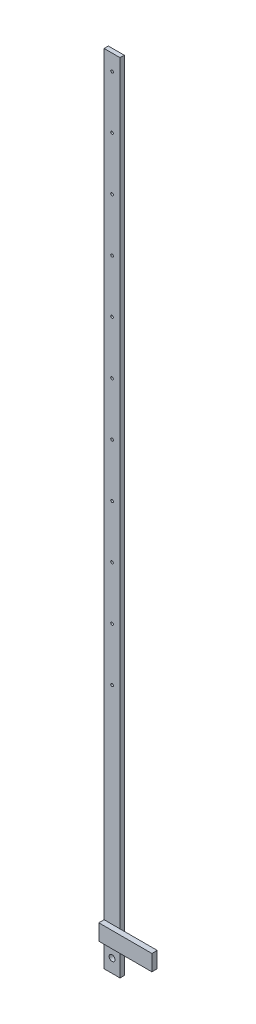
ISO-10303-21;
HEADER;
FILE_DESCRIPTION(('STEP AP214'),'2;1');
FILE_NAME('part.step','',(''),(''),'','','');
FILE_SCHEMA(('AUTOMOTIVE_DESIGN { 1 0 10303 214 1 1 1 1 }'));
ENDSEC;
DATA;
#1=APPLICATION_CONTEXT('core data for automotive mechanical design processes');
#2=APPLICATION_PROTOCOL_DEFINITION('international standard','automotive_design',2000,#1);
#3=PRODUCT_CONTEXT('',#1,'mechanical');
#4=PRODUCT('Part','Part','',(#3));
#5=PRODUCT_RELATED_PRODUCT_CATEGORY('part','',(#4));
#6=PRODUCT_DEFINITION_FORMATION('','',#4);
#7=PRODUCT_DEFINITION_CONTEXT('part definition',#1,'design');
#8=PRODUCT_DEFINITION('design','',#6,#7);
#9=PRODUCT_DEFINITION_SHAPE('','',#8);
#10=(LENGTH_UNIT() NAMED_UNIT(*) SI_UNIT(.MILLI.,.METRE.));
#11=(NAMED_UNIT(*) PLANE_ANGLE_UNIT() SI_UNIT($,.RADIAN.));
#12=(NAMED_UNIT(*) SI_UNIT($,.STERADIAN.) SOLID_ANGLE_UNIT());
#13=UNCERTAINTY_MEASURE_WITH_UNIT(LENGTH_MEASURE(1.E-05),#10,'distance_accuracy_value','');
#14=(GEOMETRIC_REPRESENTATION_CONTEXT(3) GLOBAL_UNCERTAINTY_ASSIGNED_CONTEXT((#13)) GLOBAL_UNIT_ASSIGNED_CONTEXT((#10,
#11,#12)) REPRESENTATION_CONTEXT('',''));
#15=CARTESIAN_POINT('',(0.,0.,0.));
#16=DIRECTION('',(0.,0.,1.));
#17=DIRECTION('',(1.,0.,0.));
#18=AXIS2_PLACEMENT_3D('',#15,#16,#17);
#19=CARTESIAN_POINT('',(0.,0.,0.8));
#20=DIRECTION('',(0.,0.,-1.));
#21=DIRECTION('',(-1.,0.,0.));
#22=AXIS2_PLACEMENT_3D('',#19,#20,#21);
#23=PLANE('',#22);
#24=CARTESIAN_POINT('',(-3.08114075777285E-13,44.5,0.8));
#25=DIRECTION('',(0.,0.,1.));
#26=DIRECTION('',(1.,0.,0.));
#27=AXIS2_PLACEMENT_3D('',#24,#25,#26);
#28=CIRCLE('',#27,0.25);
#29=CARTESIAN_POINT('',(0.249999999999692,44.5,0.8));
#30=VERTEX_POINT('',#29);
#31=EDGE_CURVE('E131',#30,#30,#28,.T.);
#32=ORIENTED_EDGE('',*,*,#31,.F.);
#33=EDGE_LOOP('',(#32));
#34=FACE_BOUND('',#33,.T.);
#35=CARTESIAN_POINT('',(1.10311582467672E-13,84.5,0.8));
#36=DIRECTION('',(0.,0.,1.));
#37=DIRECTION('',(1.,0.,0.));
#38=AXIS2_PLACEMENT_3D('',#35,#36,#37);
#39=CIRCLE('',#38,0.24999999999986);
#40=CARTESIAN_POINT('',(0.24999999999997,84.5,0.8));
#41=VERTEX_POINT('',#40);
#42=EDGE_CURVE('E495',#41,#41,#39,.T.);
#43=ORIENTED_EDGE('',*,*,#42,.F.);
#44=EDGE_LOOP('',(#43));
#45=FACE_BOUND('',#44,.T.);
#46=CARTESIAN_POINT('',(-3.08114075777285E-13,54.5,0.8));
#47=DIRECTION('',(0.,0.,1.));
#48=DIRECTION('',(1.,0.,0.));
#49=AXIS2_PLACEMENT_3D('',#46,#47,#48);
#50=CIRCLE('',#49,0.25);
#51=CARTESIAN_POINT('',(0.249999999999692,54.5,0.8));
#52=VERTEX_POINT('',#51);
#53=EDGE_CURVE('E483',#52,#52,#50,.T.);
#54=ORIENTED_EDGE('',*,*,#53,.F.);
#55=EDGE_LOOP('',(#54));
#56=FACE_BOUND('',#55,.T.);
#57=CARTESIAN_POINT('',(0.,104.5,0.8));
#58=DIRECTION('',(0.,0.,1.));
#59=DIRECTION('',(1.,0.,0.));
#60=AXIS2_PLACEMENT_3D('',#57,#58,#59);
#61=CIRCLE('',#60,0.249999999999907);
#62=CARTESIAN_POINT('',(0.249999999999968,104.5,0.8));
#63=VERTEX_POINT('',#62);
#64=EDGE_CURVE('E471',#63,#63,#61,.T.);
#65=ORIENTED_EDGE('',*,*,#64,.F.);
#66=EDGE_LOOP('',(#65));
#67=FACE_BOUND('',#66,.T.);
#68=CARTESIAN_POINT('',(0.,124.5,0.8));
#69=DIRECTION('',(0.,0.,1.));
#70=DIRECTION('',(1.,0.,0.));
#71=AXIS2_PLACEMENT_3D('',#68,#69,#70);
#72=CIRCLE('',#71,0.24999999999995);
#73=CARTESIAN_POINT('',(0.249999999999962,124.5,0.8));
#74=VERTEX_POINT('',#73);
#75=EDGE_CURVE('E459',#74,#74,#72,.T.);
#76=ORIENTED_EDGE('',*,*,#75,.F.);
#77=EDGE_LOOP('',(#76));
#78=FACE_BOUND('',#77,.T.);
#79=CARTESIAN_POINT('',(0.,144.5,0.8));
#80=DIRECTION('',(0.,0.,1.));
#81=DIRECTION('',(1.,0.,0.));
#82=AXIS2_PLACEMENT_3D('',#79,#80,#81);
#83=CIRCLE('',#82,0.250000000000008);
#84=CARTESIAN_POINT('',(0.249999999999973,144.5,0.8));
#85=VERTEX_POINT('',#84);
#86=EDGE_CURVE('E447',#85,#85,#83,.T.);
#87=ORIENTED_EDGE('',*,*,#86,.F.);
#88=EDGE_LOOP('',(#87));
#89=FACE_BOUND('',#88,.T.);
#90=CARTESIAN_POINT('',(0.,134.5,0.8));
#91=DIRECTION('',(0.,0.,1.));
#92=DIRECTION('',(1.,0.,0.));
#93=AXIS2_PLACEMENT_3D('',#90,#91,#92);
#94=CIRCLE('',#93,0.249999999999977);
#95=CARTESIAN_POINT('',(0.249999999999965,134.5,0.8));
#96=VERTEX_POINT('',#95);
#97=EDGE_CURVE('E453',#96,#96,#94,.T.);
#98=ORIENTED_EDGE('',*,*,#97,.F.);
#99=EDGE_LOOP('',(#98));
#100=FACE_BOUND('',#99,.T.);
#101=CARTESIAN_POINT('',(0.,114.5,0.8));
#102=DIRECTION('',(0.,0.,1.));
#103=DIRECTION('',(1.,0.,0.));
#104=AXIS2_PLACEMENT_3D('',#101,#102,#103);
#105=CIRCLE('',#104,0.249999999999926);
#106=CARTESIAN_POINT('',(0.249999999999963,114.5,0.8));
#107=VERTEX_POINT('',#106);
#108=EDGE_CURVE('E465',#107,#107,#105,.T.);
#109=ORIENTED_EDGE('',*,*,#108,.F.);
#110=EDGE_LOOP('',(#109));
#111=FACE_BOUND('',#110,.T.);
#112=CARTESIAN_POINT('',(-3.08114075777286E-13,64.5,0.8));
#113=DIRECTION('',(0.,0.,1.));
#114=DIRECTION('',(1.,0.,0.));
#115=AXIS2_PLACEMENT_3D('',#112,#113,#114);
#116=CIRCLE('',#115,0.25);
#117=CARTESIAN_POINT('',(0.249999999999692,64.5,0.8));
#118=VERTEX_POINT('',#117);
#119=EDGE_CURVE('E477',#118,#118,#116,.T.);
#120=ORIENTED_EDGE('',*,*,#119,.F.);
#121=EDGE_LOOP('',(#120));
#122=FACE_BOUND('',#121,.T.);
#123=CARTESIAN_POINT('',(0.,94.5,0.8));
#124=DIRECTION('',(0.,0.,1.));
#125=DIRECTION('',(1.,0.,0.));
#126=AXIS2_PLACEMENT_3D('',#123,#124,#125);
#127=CIRCLE('',#126,0.249999999999884);
#128=CARTESIAN_POINT('',(0.249999999999969,94.5,0.8));
#129=VERTEX_POINT('',#128);
#130=EDGE_CURVE('E489',#129,#129,#127,.T.);
#131=ORIENTED_EDGE('',*,*,#130,.F.);
#132=EDGE_LOOP('',(#131));
#133=FACE_BOUND('',#132,.T.);
#134=CARTESIAN_POINT('',(1.34804518450619E-13,74.5,0.8));
#135=DIRECTION('',(0.,0.,1.));
#136=DIRECTION('',(1.,0.,0.));
#137=AXIS2_PLACEMENT_3D('',#134,#135,#136);
#138=CIRCLE('',#137,0.249999999999833);
#139=CARTESIAN_POINT('',(0.249999999999968,74.5,0.8));
#140=VERTEX_POINT('',#139);
#141=EDGE_CURVE('E501',#140,#140,#138,.T.);
#142=ORIENTED_EDGE('',*,*,#141,.F.);
#143=EDGE_LOOP('',(#142));
#144=FACE_BOUND('',#143,.T.);
#145=DIRECTION('',(-1.,0.,0.));
#146=VECTOR('',#145,1.);
#147=CARTESIAN_POINT('',(-1.50000000000004,5.5,0.8));
#148=LINE('',#147,#146);
#149=CARTESIAN_POINT('',(1.5,5.5,0.8));
#150=VERTEX_POINT('',#149);
#151=CARTESIAN_POINT('',(-1.5,5.5,0.8));
#152=VERTEX_POINT('',#151);
#153=EDGE_CURVE('E11',#150,#152,#148,.T.);
#154=ORIENTED_EDGE('',*,*,#153,.F.);
#155=DIRECTION('',(0.,1.,0.));
#156=VECTOR('',#155,1.);
#157=CARTESIAN_POINT('',(1.5,-2.5,0.8));
#158=LINE('',#157,#156);
#159=CARTESIAN_POINT('',(1.5,147.5,0.8));
#160=VERTEX_POINT('',#159);
#161=EDGE_CURVE('E166',#150,#160,#158,.T.);
#162=ORIENTED_EDGE('',*,*,#161,.T.);
#163=DIRECTION('',(-1.,0.,0.));
#164=VECTOR('',#163,1.);
#165=CARTESIAN_POINT('',(-1.50000000000004,147.5,0.8));
#166=LINE('',#165,#164);
#167=CARTESIAN_POINT('',(-1.50000000000004,147.5,0.8));
#168=VERTEX_POINT('',#167);
#169=EDGE_CURVE('E169',#160,#168,#166,.T.);
#170=ORIENTED_EDGE('',*,*,#169,.T.);
#171=DIRECTION('',(0.,-1.,0.));
#172=VECTOR('',#171,1.);
#173=CARTESIAN_POINT('',(-1.5,-2.5,0.8));
#174=LINE('',#173,#172);
#175=EDGE_CURVE('E155',#168,#152,#174,.T.);
#176=ORIENTED_EDGE('',*,*,#175,.T.);
#177=EDGE_LOOP('',(#154,#162,#170,#176));
#178=FACE_BOUND('',#177,.T.);
#179=ADVANCED_FACE('F33',(#34,#45,#56,#67,#78,#89,#100,#111,#122,#133,#144,#178),#23,.F.);
#180=CARTESIAN_POINT('',(0.,0.,0.8));
#181=DIRECTION('',(0.,0.,1.));
#182=DIRECTION('',(1.,0.,0.));
#183=AXIS2_PLACEMENT_3D('',#180,#181,#182);
#184=CIRCLE('',#183,0.55);
#185=CARTESIAN_POINT('',(0.55,0.,0.8));
#186=VERTEX_POINT('',#185);
#187=EDGE_CURVE('E176',#186,#186,#184,.T.);
#188=ORIENTED_EDGE('',*,*,#187,.F.);
#189=EDGE_LOOP('',(#188));
#190=FACE_BOUND('',#189,.T.);
#191=DIRECTION('',(1.,0.,0.));
#192=VECTOR('',#191,1.);
#193=CARTESIAN_POINT('',(-1.50000000000004,2.5,0.8));
#194=LINE('',#193,#192);
#195=CARTESIAN_POINT('',(-1.5,2.5,0.8));
#196=VERTEX_POINT('',#195);
#197=CARTESIAN_POINT('',(1.5,2.5,0.8));
#198=VERTEX_POINT('',#197);
#199=EDGE_CURVE('E56',#196,#198,#194,.T.);
#200=ORIENTED_EDGE('',*,*,#199,.F.);
#201=CARTESIAN_POINT('',(-1.5,-2.5,0.8));
#202=VERTEX_POINT('',#201);
#203=EDGE_CURVE('E127',#196,#202,#174,.T.);
#204=ORIENTED_EDGE('',*,*,#203,.T.);
#205=DIRECTION('',(1.,0.,0.));
#206=VECTOR('',#205,1.);
#207=CARTESIAN_POINT('',(-1.5,-2.5,0.8));
#208=LINE('',#207,#206);
#209=CARTESIAN_POINT('',(1.5,-2.5,0.8));
#210=VERTEX_POINT('',#209);
#211=EDGE_CURVE('E163',#202,#210,#208,.T.);
#212=ORIENTED_EDGE('',*,*,#211,.T.);
#213=EDGE_CURVE('E167',#210,#198,#158,.T.);
#214=ORIENTED_EDGE('',*,*,#213,.T.);
#215=EDGE_LOOP('',(#200,#204,#212,#214));
#216=FACE_BOUND('',#215,.T.);
#217=ADVANCED_FACE('F228',(#190,#216),#23,.F.);
#218=CARTESIAN_POINT('',(0.,0.,0.));
#219=DIRECTION('',(0.,0.,-1.));
#220=DIRECTION('',(-1.,0.,0.));
#221=AXIS2_PLACEMENT_3D('',#218,#219,#220);
#222=PLANE('',#221);
#223=CARTESIAN_POINT('',(1.34804518450619E-13,74.5,0.));
#224=DIRECTION('',(0.,0.,1.));
#225=DIRECTION('',(1.,0.,0.));
#226=AXIS2_PLACEMENT_3D('',#223,#224,#225);
#227=CIRCLE('',#226,0.249999999999833);
#228=CARTESIAN_POINT('',(0.249999999999968,74.5,0.));
#229=VERTEX_POINT('',#228);
#230=EDGE_CURVE('E504',#229,#229,#227,.T.);
#231=ORIENTED_EDGE('',*,*,#230,.T.);
#232=EDGE_LOOP('',(#231));
#233=FACE_BOUND('',#232,.T.);
#234=CARTESIAN_POINT('',(0.,94.5,0.));
#235=DIRECTION('',(0.,0.,1.));
#236=DIRECTION('',(1.,0.,0.));
#237=AXIS2_PLACEMENT_3D('',#234,#235,#236);
#238=CIRCLE('',#237,0.249999999999884);
#239=CARTESIAN_POINT('',(0.249999999999969,94.5,0.));
#240=VERTEX_POINT('',#239);
#241=EDGE_CURVE('E492',#240,#240,#238,.T.);
#242=ORIENTED_EDGE('',*,*,#241,.T.);
#243=EDGE_LOOP('',(#242));
#244=FACE_BOUND('',#243,.T.);
#245=CARTESIAN_POINT('',(-3.08114075777286E-13,64.5,0.));
#246=DIRECTION('',(0.,0.,1.));
#247=DIRECTION('',(1.,0.,0.));
#248=AXIS2_PLACEMENT_3D('',#245,#246,#247);
#249=CIRCLE('',#248,0.25);
#250=CARTESIAN_POINT('',(0.249999999999692,64.5,0.));
#251=VERTEX_POINT('',#250);
#252=EDGE_CURVE('E480',#251,#251,#249,.T.);
#253=ORIENTED_EDGE('',*,*,#252,.T.);
#254=EDGE_LOOP('',(#253));
#255=FACE_BOUND('',#254,.T.);
#256=CARTESIAN_POINT('',(0.,114.5,0.));
#257=DIRECTION('',(0.,0.,1.));
#258=DIRECTION('',(1.,0.,0.));
#259=AXIS2_PLACEMENT_3D('',#256,#257,#258);
#260=CIRCLE('',#259,0.249999999999926);
#261=CARTESIAN_POINT('',(0.249999999999963,114.5,0.));
#262=VERTEX_POINT('',#261);
#263=EDGE_CURVE('E468',#262,#262,#260,.T.);
#264=ORIENTED_EDGE('',*,*,#263,.T.);
#265=EDGE_LOOP('',(#264));
#266=FACE_BOUND('',#265,.T.);
#267=CARTESIAN_POINT('',(0.,134.5,0.));
#268=DIRECTION('',(0.,0.,1.));
#269=DIRECTION('',(1.,0.,0.));
#270=AXIS2_PLACEMENT_3D('',#267,#268,#269);
#271=CIRCLE('',#270,0.249999999999977);
#272=CARTESIAN_POINT('',(0.249999999999965,134.5,0.));
#273=VERTEX_POINT('',#272);
#274=EDGE_CURVE('E456',#273,#273,#271,.T.);
#275=ORIENTED_EDGE('',*,*,#274,.T.);
#276=EDGE_LOOP('',(#275));
#277=FACE_BOUND('',#276,.T.);
#278=CARTESIAN_POINT('',(0.,0.,0.));
#279=DIRECTION('',(0.,0.,1.));
#280=DIRECTION('',(1.,0.,0.));
#281=AXIS2_PLACEMENT_3D('',#278,#279,#280);
#282=CIRCLE('',#281,0.55);
#283=CARTESIAN_POINT('',(0.55,0.,0.));
#284=VERTEX_POINT('',#283);
#285=EDGE_CURVE('E161',#284,#284,#282,.T.);
#286=ORIENTED_EDGE('',*,*,#285,.T.);
#287=EDGE_LOOP('',(#286));
#288=FACE_BOUND('',#287,.T.);
#289=DIRECTION('',(0.,-1.,0.));
#290=VECTOR('',#289,1.);
#291=CARTESIAN_POINT('',(-1.5,-2.5,0.));
#292=LINE('',#291,#290);
#293=CARTESIAN_POINT('',(-1.50000000000004,147.5,0.));
#294=VERTEX_POINT('',#293);
#295=CARTESIAN_POINT('',(-1.5,-2.5,0.));
#296=VERTEX_POINT('',#295);
#297=EDGE_CURVE('E173',#294,#296,#292,.T.);
#298=ORIENTED_EDGE('',*,*,#297,.F.);
#299=DIRECTION('',(-1.,0.,0.));
#300=VECTOR('',#299,1.);
#301=CARTESIAN_POINT('',(-1.50000000000004,147.5,0.));
#302=LINE('',#301,#300);
#303=CARTESIAN_POINT('',(1.5,147.5,0.));
#304=VERTEX_POINT('',#303);
#305=EDGE_CURVE('E156',#304,#294,#302,.T.);
#306=ORIENTED_EDGE('',*,*,#305,.F.);
#307=DIRECTION('',(0.,1.,0.));
#308=VECTOR('',#307,1.);
#309=CARTESIAN_POINT('',(1.5,-2.5,0.));
#310=LINE('',#309,#308);
#311=CARTESIAN_POINT('',(1.5,-2.5,0.));
#312=VERTEX_POINT('',#311);
#313=EDGE_CURVE('E178',#312,#304,#310,.T.);
#314=ORIENTED_EDGE('',*,*,#313,.F.);
#315=DIRECTION('',(1.,0.,0.));
#316=VECTOR('',#315,1.);
#317=CARTESIAN_POINT('',(-1.5,-2.5,0.));
#318=LINE('',#317,#316);
#319=EDGE_CURVE('E175',#296,#312,#318,.T.);
#320=ORIENTED_EDGE('',*,*,#319,.F.);
#321=EDGE_LOOP('',(#298,#306,#314,#320));
#322=FACE_BOUND('',#321,.T.);
#323=CARTESIAN_POINT('',(0.,144.5,0.));
#324=DIRECTION('',(0.,0.,1.));
#325=DIRECTION('',(1.,0.,0.));
#326=AXIS2_PLACEMENT_3D('',#323,#324,#325);
#327=CIRCLE('',#326,0.250000000000008);
#328=CARTESIAN_POINT('',(0.249999999999973,144.5,0.));
#329=VERTEX_POINT('',#328);
#330=EDGE_CURVE('E449',#329,#329,#327,.T.);
#331=ORIENTED_EDGE('',*,*,#330,.T.);
#332=EDGE_LOOP('',(#331));
#333=FACE_BOUND('',#332,.T.);
#334=CARTESIAN_POINT('',(0.,124.5,0.));
#335=DIRECTION('',(0.,0.,1.));
#336=DIRECTION('',(1.,0.,0.));
#337=AXIS2_PLACEMENT_3D('',#334,#335,#336);
#338=CIRCLE('',#337,0.24999999999995);
#339=CARTESIAN_POINT('',(0.249999999999962,124.5,0.));
#340=VERTEX_POINT('',#339);
#341=EDGE_CURVE('E462',#340,#340,#338,.T.);
#342=ORIENTED_EDGE('',*,*,#341,.T.);
#343=EDGE_LOOP('',(#342));
#344=FACE_BOUND('',#343,.T.);
#345=CARTESIAN_POINT('',(0.,104.5,0.));
#346=DIRECTION('',(0.,0.,1.));
#347=DIRECTION('',(1.,0.,0.));
#348=AXIS2_PLACEMENT_3D('',#345,#346,#347);
#349=CIRCLE('',#348,0.249999999999907);
#350=CARTESIAN_POINT('',(0.249999999999968,104.5,0.));
#351=VERTEX_POINT('',#350);
#352=EDGE_CURVE('E474',#351,#351,#349,.T.);
#353=ORIENTED_EDGE('',*,*,#352,.T.);
#354=EDGE_LOOP('',(#353));
#355=FACE_BOUND('',#354,.T.);
#356=CARTESIAN_POINT('',(-3.08114075777285E-13,54.5,0.));
#357=DIRECTION('',(0.,0.,1.));
#358=DIRECTION('',(1.,0.,0.));
#359=AXIS2_PLACEMENT_3D('',#356,#357,#358);
#360=CIRCLE('',#359,0.25);
#361=CARTESIAN_POINT('',(0.249999999999692,54.5,0.));
#362=VERTEX_POINT('',#361);
#363=EDGE_CURVE('E486',#362,#362,#360,.T.);
#364=ORIENTED_EDGE('',*,*,#363,.T.);
#365=EDGE_LOOP('',(#364));
#366=FACE_BOUND('',#365,.T.);
#367=CARTESIAN_POINT('',(1.10311582467672E-13,84.5,0.));
#368=DIRECTION('',(0.,0.,1.));
#369=DIRECTION('',(1.,0.,0.));
#370=AXIS2_PLACEMENT_3D('',#367,#368,#369);
#371=CIRCLE('',#370,0.24999999999986);
#372=CARTESIAN_POINT('',(0.24999999999997,84.5,0.));
#373=VERTEX_POINT('',#372);
#374=EDGE_CURVE('E498',#373,#373,#371,.T.);
#375=ORIENTED_EDGE('',*,*,#374,.T.);
#376=EDGE_LOOP('',(#375));
#377=FACE_BOUND('',#376,.T.);
#378=CARTESIAN_POINT('',(-3.08114075777285E-13,44.5,0.));
#379=DIRECTION('',(0.,0.,1.));
#380=DIRECTION('',(1.,0.,0.));
#381=AXIS2_PLACEMENT_3D('',#378,#379,#380);
#382=CIRCLE('',#381,0.25);
#383=CARTESIAN_POINT('',(0.249999999999692,44.5,0.));
#384=VERTEX_POINT('',#383);
#385=EDGE_CURVE('E128',#384,#384,#382,.T.);
#386=ORIENTED_EDGE('',*,*,#385,.T.);
#387=EDGE_LOOP('',(#386));
#388=FACE_BOUND('',#387,.T.);
#389=ADVANCED_FACE('F197',(#233,#244,#255,#266,#277,#288,#322,#333,#344,#355,#366,#377,#388),
#222,.T.);
#390=CARTESIAN_POINT('',(-1.5,-2.5,0.8));
#391=DIRECTION('',(1.,0.,0.));
#392=DIRECTION('',(0.,1.,0.));
#393=AXIS2_PLACEMENT_3D('',#390,#391,#392);
#394=PLANE('',#393);
#395=ORIENTED_EDGE('',*,*,#297,.T.);
#396=DIRECTION('',(0.,0.,-1.));
#397=VECTOR('',#396,1.);
#398=CARTESIAN_POINT('',(-1.5,-2.5,0.8));
#399=LINE('',#398,#397);
#400=EDGE_CURVE('E42',#202,#296,#399,.T.);
#401=ORIENTED_EDGE('',*,*,#400,.F.);
#402=ORIENTED_EDGE('',*,*,#203,.F.);
#403=DIRECTION('',(0.,0.,-1.));
#404=VECTOR('',#403,1.);
#405=CARTESIAN_POINT('',(-1.50000000000004,2.5,1.8));
#406=LINE('',#405,#404);
#407=CARTESIAN_POINT('',(-1.50000000000004,2.5,1.8));
#408=VERTEX_POINT('',#407);
#409=EDGE_CURVE('E108',#408,#196,#406,.T.);
#410=ORIENTED_EDGE('',*,*,#409,.F.);
#411=DIRECTION('',(0.,-1.,0.));
#412=VECTOR('',#411,1.);
#413=CARTESIAN_POINT('',(-1.50000000000004,5.5,1.8));
#414=LINE('',#413,#412);
#415=CARTESIAN_POINT('',(-1.50000000000004,5.5,1.8));
#416=VERTEX_POINT('',#415);
#417=EDGE_CURVE('E114',#416,#408,#414,.T.);
#418=ORIENTED_EDGE('',*,*,#417,.F.);
#419=DIRECTION('',(0.,0.,-1.));
#420=VECTOR('',#419,1.);
#421=CARTESIAN_POINT('',(-1.50000000000004,5.5,1.8));
#422=LINE('',#421,#420);
#423=EDGE_CURVE('E139',#416,#152,#422,.T.);
#424=ORIENTED_EDGE('',*,*,#423,.T.);
#425=ORIENTED_EDGE('',*,*,#175,.F.);
#426=DIRECTION('',(0.,0.,-1.));
#427=VECTOR('',#426,1.);
#428=CARTESIAN_POINT('',(-1.50000000000004,147.5,0.8));
#429=LINE('',#428,#427);
#430=EDGE_CURVE('E172',#168,#294,#429,.T.);
#431=ORIENTED_EDGE('',*,*,#430,.T.);
#432=EDGE_LOOP('',(#395,#401,#402,#410,#418,#424,#425,#431));
#433=FACE_BOUND('',#432,.T.);
#434=ADVANCED_FACE('F35',(#433),#394,.F.);
#435=CARTESIAN_POINT('',(-1.5,-2.5,0.8));
#436=DIRECTION('',(0.,1.,0.));
#437=DIRECTION('',(0.,0.,1.));
#438=AXIS2_PLACEMENT_3D('',#435,#436,#437);
#439=PLANE('',#438);
#440=ORIENTED_EDGE('',*,*,#319,.T.);
#441=DIRECTION('',(0.,0.,-1.));
#442=VECTOR('',#441,1.);
#443=CARTESIAN_POINT('',(1.5,-2.5,0.8));
#444=LINE('',#443,#442);
#445=EDGE_CURVE('E186',#210,#312,#444,.T.);
#446=ORIENTED_EDGE('',*,*,#445,.F.);
#447=ORIENTED_EDGE('',*,*,#211,.F.);
#448=ORIENTED_EDGE('',*,*,#400,.T.);
#449=EDGE_LOOP('',(#440,#446,#447,#448));
#450=FACE_BOUND('',#449,.T.);
#451=ADVANCED_FACE('F191',(#450),#439,.F.);
#452=CARTESIAN_POINT('',(1.5,-2.5,0.8));
#453=DIRECTION('',(-1.,0.,0.));
#454=DIRECTION('',(0.,-1.,0.));
#455=AXIS2_PLACEMENT_3D('',#452,#453,#454);
#456=PLANE('',#455);
#457=ORIENTED_EDGE('',*,*,#313,.T.);
#458=DIRECTION('',(0.,0.,-1.));
#459=VECTOR('',#458,1.);
#460=CARTESIAN_POINT('',(1.5,147.5,0.8));
#461=LINE('',#460,#459);
#462=EDGE_CURVE('E183',#160,#304,#461,.T.);
#463=ORIENTED_EDGE('',*,*,#462,.F.);
#464=ORIENTED_EDGE('',*,*,#161,.F.);
#465=EDGE_CURVE('E170',#198,#150,#158,.T.);
#466=ORIENTED_EDGE('',*,*,#465,.F.);
#467=ORIENTED_EDGE('',*,*,#213,.F.);
#468=ORIENTED_EDGE('',*,*,#445,.T.);
#469=EDGE_LOOP('',(#457,#463,#464,#466,#467,#468));
#470=FACE_BOUND('',#469,.T.);
#471=ADVANCED_FACE('F202',(#470),#456,.F.);
#472=CARTESIAN_POINT('',(-1.50000000000004,147.5,0.8));
#473=DIRECTION('',(0.,-1.,0.));
#474=DIRECTION('',(1.,0.,0.));
#475=AXIS2_PLACEMENT_3D('',#472,#473,#474);
#476=PLANE('',#475);
#477=ORIENTED_EDGE('',*,*,#305,.T.);
#478=ORIENTED_EDGE('',*,*,#430,.F.);
#479=ORIENTED_EDGE('',*,*,#169,.F.);
#480=ORIENTED_EDGE('',*,*,#462,.T.);
#481=EDGE_LOOP('',(#477,#478,#479,#480));
#482=FACE_BOUND('',#481,.T.);
#483=ADVANCED_FACE('F206',(#482),#476,.F.);
#484=CARTESIAN_POINT('',(0.,0.,0.8));
#485=DIRECTION('',(0.,0.,-1.));
#486=DIRECTION('',(-1.,0.,0.));
#487=AXIS2_PLACEMENT_3D('',#484,#485,#486);
#488=CYLINDRICAL_SURFACE('',#487,0.55);
#489=ORIENTED_EDGE('',*,*,#187,.T.);
#490=EDGE_LOOP('',(#489));
#491=FACE_BOUND('',#490,.T.);
#492=ORIENTED_EDGE('',*,*,#285,.F.);
#493=EDGE_LOOP('',(#492));
#494=FACE_BOUND('',#493,.T.);
#495=ADVANCED_FACE('F239',(#491,#494),#488,.F.);
#496=CARTESIAN_POINT('',(0.,144.5,0.8));
#497=DIRECTION('',(0.,0.,-1.));
#498=DIRECTION('',(-1.,0.,0.));
#499=AXIS2_PLACEMENT_3D('',#496,#497,#498);
#500=CYLINDRICAL_SURFACE('',#499,0.250000000000008);
#501=ORIENTED_EDGE('',*,*,#86,.T.);
#502=EDGE_LOOP('',(#501));
#503=FACE_BOUND('',#502,.T.);
#504=ORIENTED_EDGE('',*,*,#330,.F.);
#505=EDGE_LOOP('',(#504));
#506=FACE_BOUND('',#505,.T.);
#507=ADVANCED_FACE('F367',(#503,#506),#500,.F.);
#508=CARTESIAN_POINT('',(0.,134.5,0.8));
#509=DIRECTION('',(0.,0.,-1.));
#510=DIRECTION('',(-1.,0.,0.));
#511=AXIS2_PLACEMENT_3D('',#508,#509,#510);
#512=CYLINDRICAL_SURFACE('',#511,0.249999999999977);
#513=ORIENTED_EDGE('',*,*,#97,.T.);
#514=EDGE_LOOP('',(#513));
#515=FACE_BOUND('',#514,.T.);
#516=ORIENTED_EDGE('',*,*,#274,.F.);
#517=EDGE_LOOP('',(#516));
#518=FACE_BOUND('',#517,.T.);
#519=ADVANCED_FACE('F357',(#515,#518),#512,.F.);
#520=CARTESIAN_POINT('',(0.,124.5,0.8));
#521=DIRECTION('',(0.,0.,-1.));
#522=DIRECTION('',(-1.,0.,0.));
#523=AXIS2_PLACEMENT_3D('',#520,#521,#522);
#524=CYLINDRICAL_SURFACE('',#523,0.24999999999995);
#525=ORIENTED_EDGE('',*,*,#75,.T.);
#526=EDGE_LOOP('',(#525));
#527=FACE_BOUND('',#526,.T.);
#528=ORIENTED_EDGE('',*,*,#341,.F.);
#529=EDGE_LOOP('',(#528));
#530=FACE_BOUND('',#529,.T.);
#531=ADVANCED_FACE('F347',(#527,#530),#524,.F.);
#532=CARTESIAN_POINT('',(0.,114.5,0.8));
#533=DIRECTION('',(0.,0.,-1.));
#534=DIRECTION('',(-1.,0.,0.));
#535=AXIS2_PLACEMENT_3D('',#532,#533,#534);
#536=CYLINDRICAL_SURFACE('',#535,0.249999999999926);
#537=ORIENTED_EDGE('',*,*,#108,.T.);
#538=EDGE_LOOP('',(#537));
#539=FACE_BOUND('',#538,.T.);
#540=ORIENTED_EDGE('',*,*,#263,.F.);
#541=EDGE_LOOP('',(#540));
#542=FACE_BOUND('',#541,.T.);
#543=ADVANCED_FACE('F337',(#539,#542),#536,.F.);
#544=CARTESIAN_POINT('',(0.,104.5,0.8));
#545=DIRECTION('',(0.,0.,-1.));
#546=DIRECTION('',(-1.,0.,0.));
#547=AXIS2_PLACEMENT_3D('',#544,#545,#546);
#548=CYLINDRICAL_SURFACE('',#547,0.249999999999907);
#549=ORIENTED_EDGE('',*,*,#64,.T.);
#550=EDGE_LOOP('',(#549));
#551=FACE_BOUND('',#550,.T.);
#552=ORIENTED_EDGE('',*,*,#352,.F.);
#553=EDGE_LOOP('',(#552));
#554=FACE_BOUND('',#553,.T.);
#555=ADVANCED_FACE('F327',(#551,#554),#548,.F.);
#556=CARTESIAN_POINT('',(-3.08114075777286E-13,64.5,0.8));
#557=DIRECTION('',(0.,0.,-1.));
#558=DIRECTION('',(-1.,0.,0.));
#559=AXIS2_PLACEMENT_3D('',#556,#557,#558);
#560=CYLINDRICAL_SURFACE('',#559,0.25);
#561=ORIENTED_EDGE('',*,*,#119,.T.);
#562=EDGE_LOOP('',(#561));
#563=FACE_BOUND('',#562,.T.);
#564=ORIENTED_EDGE('',*,*,#252,.F.);
#565=EDGE_LOOP('',(#564));
#566=FACE_BOUND('',#565,.T.);
#567=ADVANCED_FACE('F317',(#563,#566),#560,.F.);
#568=CARTESIAN_POINT('',(-3.08114075777285E-13,54.5,0.8));
#569=DIRECTION('',(0.,0.,-1.));
#570=DIRECTION('',(-1.,0.,0.));
#571=AXIS2_PLACEMENT_3D('',#568,#569,#570);
#572=CYLINDRICAL_SURFACE('',#571,0.25);
#573=ORIENTED_EDGE('',*,*,#53,.T.);
#574=EDGE_LOOP('',(#573));
#575=FACE_BOUND('',#574,.T.);
#576=ORIENTED_EDGE('',*,*,#363,.F.);
#577=EDGE_LOOP('',(#576));
#578=FACE_BOUND('',#577,.T.);
#579=ADVANCED_FACE('F307',(#575,#578),#572,.F.);
#580=CARTESIAN_POINT('',(0.,94.5,0.8));
#581=DIRECTION('',(0.,0.,-1.));
#582=DIRECTION('',(-1.,0.,0.));
#583=AXIS2_PLACEMENT_3D('',#580,#581,#582);
#584=CYLINDRICAL_SURFACE('',#583,0.249999999999884);
#585=ORIENTED_EDGE('',*,*,#130,.T.);
#586=EDGE_LOOP('',(#585));
#587=FACE_BOUND('',#586,.T.);
#588=ORIENTED_EDGE('',*,*,#241,.F.);
#589=EDGE_LOOP('',(#588));
#590=FACE_BOUND('',#589,.T.);
#591=ADVANCED_FACE('F297',(#587,#590),#584,.F.);
#592=CARTESIAN_POINT('',(1.10311582467672E-13,84.5,0.8));
#593=DIRECTION('',(0.,0.,-1.));
#594=DIRECTION('',(-1.,0.,0.));
#595=AXIS2_PLACEMENT_3D('',#592,#593,#594);
#596=CYLINDRICAL_SURFACE('',#595,0.24999999999986);
#597=ORIENTED_EDGE('',*,*,#42,.T.);
#598=EDGE_LOOP('',(#597));
#599=FACE_BOUND('',#598,.T.);
#600=ORIENTED_EDGE('',*,*,#374,.F.);
#601=EDGE_LOOP('',(#600));
#602=FACE_BOUND('',#601,.T.);
#603=ADVANCED_FACE('F287',(#599,#602),#596,.F.);
#604=CARTESIAN_POINT('',(1.34804518450619E-13,74.5,0.8));
#605=DIRECTION('',(0.,0.,-1.));
#606=DIRECTION('',(-1.,0.,0.));
#607=AXIS2_PLACEMENT_3D('',#604,#605,#606);
#608=CYLINDRICAL_SURFACE('',#607,0.249999999999833);
#609=ORIENTED_EDGE('',*,*,#141,.T.);
#610=EDGE_LOOP('',(#609));
#611=FACE_BOUND('',#610,.T.);
#612=ORIENTED_EDGE('',*,*,#230,.F.);
#613=EDGE_LOOP('',(#612));
#614=FACE_BOUND('',#613,.T.);
#615=ADVANCED_FACE('F276',(#611,#614),#608,.F.);
#616=CARTESIAN_POINT('',(-3.08114075777285E-13,44.5,0.8));
#617=DIRECTION('',(0.,0.,-1.));
#618=DIRECTION('',(-1.,0.,0.));
#619=AXIS2_PLACEMENT_3D('',#616,#617,#618);
#620=CYLINDRICAL_SURFACE('',#619,0.25);
#621=ORIENTED_EDGE('',*,*,#31,.T.);
#622=EDGE_LOOP('',(#621));
#623=FACE_BOUND('',#622,.T.);
#624=ORIENTED_EDGE('',*,*,#385,.F.);
#625=EDGE_LOOP('',(#624));
#626=FACE_BOUND('',#625,.T.);
#627=ADVANCED_FACE('F272',(#623,#626),#620,.F.);
#628=CARTESIAN_POINT('',(0.,0.,0.8));
#629=DIRECTION('',(0.,0.,1.));
#630=DIRECTION('',(1.,0.,0.));
#631=AXIS2_PLACEMENT_3D('',#628,#629,#630);
#632=PLANE('',#631);
#633=CARTESIAN_POINT('',(8.49999999999996,2.5,0.8));
#634=VERTEX_POINT('',#633);
#635=EDGE_CURVE('E145',#198,#634,#194,.T.);
#636=ORIENTED_EDGE('',*,*,#635,.F.);
#637=ORIENTED_EDGE('',*,*,#465,.T.);
#638=CARTESIAN_POINT('',(8.49999999999996,5.5,0.8));
#639=VERTEX_POINT('',#638);
#640=EDGE_CURVE('E123',#639,#150,#148,.T.);
#641=ORIENTED_EDGE('',*,*,#640,.F.);
#642=DIRECTION('',(0.,1.,0.));
#643=VECTOR('',#642,1.);
#644=CARTESIAN_POINT('',(8.49999999999996,5.5,0.8));
#645=LINE('',#644,#643);
#646=EDGE_CURVE('E148',#634,#639,#645,.T.);
#647=ORIENTED_EDGE('',*,*,#646,.F.);
#648=EDGE_LOOP('',(#636,#637,#641,#647));
#649=FACE_BOUND('',#648,.T.);
#650=ADVANCED_FACE('F212',(#649),#632,.F.);
#651=CARTESIAN_POINT('',(-1.50000000000004,2.5,1.8));
#652=DIRECTION('',(0.,1.,0.));
#653=DIRECTION('',(0.,0.,1.));
#654=AXIS2_PLACEMENT_3D('',#651,#652,#653);
#655=PLANE('',#654);
#656=ORIENTED_EDGE('',*,*,#199,.T.);
#657=ORIENTED_EDGE('',*,*,#635,.T.);
#658=DIRECTION('',(0.,0.,-1.));
#659=VECTOR('',#658,1.);
#660=CARTESIAN_POINT('',(8.49999999999996,2.5,1.8));
#661=LINE('',#660,#659);
#662=CARTESIAN_POINT('',(8.49999999999996,2.5,1.8));
#663=VERTEX_POINT('',#662);
#664=EDGE_CURVE('E110',#663,#634,#661,.T.);
#665=ORIENTED_EDGE('',*,*,#664,.F.);
#666=DIRECTION('',(1.,0.,0.));
#667=VECTOR('',#666,1.);
#668=CARTESIAN_POINT('',(-1.50000000000004,2.5,1.8));
#669=LINE('',#668,#667);
#670=EDGE_CURVE('E104',#408,#663,#669,.T.);
#671=ORIENTED_EDGE('',*,*,#670,.F.);
#672=ORIENTED_EDGE('',*,*,#409,.T.);
#673=EDGE_LOOP('',(#656,#657,#665,#671,#672));
#674=FACE_BOUND('',#673,.T.);
#675=ADVANCED_FACE('F106',(#674),#655,.F.);
#676=CARTESIAN_POINT('',(8.49999999999996,5.5,1.8));
#677=DIRECTION('',(-1.,0.,0.));
#678=DIRECTION('',(0.,0.,1.));
#679=AXIS2_PLACEMENT_3D('',#676,#677,#678);
#680=PLANE('',#679);
#681=ORIENTED_EDGE('',*,*,#646,.T.);
#682=DIRECTION('',(0.,0.,-1.));
#683=VECTOR('',#682,1.);
#684=CARTESIAN_POINT('',(8.49999999999996,5.5,1.8));
#685=LINE('',#684,#683);
#686=CARTESIAN_POINT('',(8.49999999999996,5.5,1.8));
#687=VERTEX_POINT('',#686);
#688=EDGE_CURVE('E133',#687,#639,#685,.T.);
#689=ORIENTED_EDGE('',*,*,#688,.F.);
#690=DIRECTION('',(0.,1.,0.));
#691=VECTOR('',#690,1.);
#692=CARTESIAN_POINT('',(8.49999999999996,5.5,1.8));
#693=LINE('',#692,#691);
#694=EDGE_CURVE('E113',#663,#687,#693,.T.);
#695=ORIENTED_EDGE('',*,*,#694,.F.);
#696=ORIENTED_EDGE('',*,*,#664,.T.);
#697=EDGE_LOOP('',(#681,#689,#695,#696));
#698=FACE_BOUND('',#697,.T.);
#699=ADVANCED_FACE('F218',(#698),#680,.F.);
#700=CARTESIAN_POINT('',(-1.50000000000004,5.5,1.8));
#701=DIRECTION('',(0.,-1.,0.));
#702=DIRECTION('',(0.,0.,-1.));
#703=AXIS2_PLACEMENT_3D('',#700,#701,#702);
#704=PLANE('',#703);
#705=ORIENTED_EDGE('',*,*,#640,.T.);
#706=ORIENTED_EDGE('',*,*,#153,.T.);
#707=ORIENTED_EDGE('',*,*,#423,.F.);
#708=DIRECTION('',(-1.,0.,0.));
#709=VECTOR('',#708,1.);
#710=CARTESIAN_POINT('',(-1.50000000000004,5.5,1.8));
#711=LINE('',#710,#709);
#712=EDGE_CURVE('E119',#687,#416,#711,.T.);
#713=ORIENTED_EDGE('',*,*,#712,.F.);
#714=ORIENTED_EDGE('',*,*,#688,.T.);
#715=EDGE_LOOP('',(#705,#706,#707,#713,#714));
#716=FACE_BOUND('',#715,.T.);
#717=ADVANCED_FACE('F215',(#716),#704,.F.);
#718=CARTESIAN_POINT('',(0.,0.,1.8));
#719=DIRECTION('',(0.,0.,1.));
#720=DIRECTION('',(1.,0.,0.));
#721=AXIS2_PLACEMENT_3D('',#718,#719,#720);
#722=PLANE('',#721);
#723=ORIENTED_EDGE('',*,*,#417,.T.);
#724=ORIENTED_EDGE('',*,*,#670,.T.);
#725=ORIENTED_EDGE('',*,*,#694,.T.);
#726=ORIENTED_EDGE('',*,*,#712,.T.);
#727=EDGE_LOOP('',(#723,#724,#725,#726));
#728=FACE_BOUND('',#727,.T.);
#729=ADVANCED_FACE('F117',(#728),#722,.T.);
#730=CLOSED_SHELL('',(#179,#217,#389,#434,#451,#471,#483,#495,#507,#519,#531,#543,#555,#567,
#579,#591,#603,#615,#627,#650,#675,#699,#717,#729));
#731=MANIFOLD_SOLID_BREP('B2',#730);
#732=ADVANCED_BREP_SHAPE_REPRESENTATION('',(#18,#731),#14);
#733=SHAPE_DEFINITION_REPRESENTATION(#9,#732);
ENDSEC;
END-ISO-10303-21;
